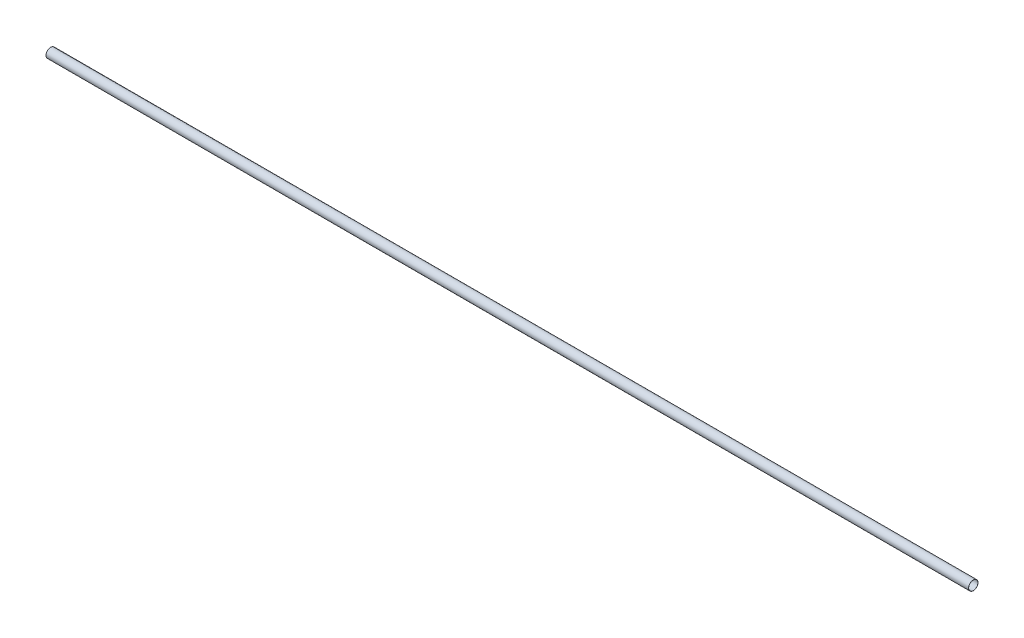
ISO-10303-21;
HEADER;
FILE_DESCRIPTION(('STEP AP214'),'2;1');
FILE_NAME('part.step','',(''),(''),'','','');
FILE_SCHEMA(('AUTOMOTIVE_DESIGN { 1 0 10303 214 1 1 1 1 }'));
ENDSEC;
DATA;
#1=APPLICATION_CONTEXT('core data for automotive mechanical design processes');
#2=APPLICATION_PROTOCOL_DEFINITION('international standard','automotive_design',2000,#1);
#3=PRODUCT_CONTEXT('',#1,'mechanical');
#4=PRODUCT('Part','Part','',(#3));
#5=PRODUCT_RELATED_PRODUCT_CATEGORY('part','',(#4));
#6=PRODUCT_DEFINITION_FORMATION('','',#4);
#7=PRODUCT_DEFINITION_CONTEXT('part definition',#1,'design');
#8=PRODUCT_DEFINITION('design','',#6,#7);
#9=PRODUCT_DEFINITION_SHAPE('','',#8);
#10=(LENGTH_UNIT() NAMED_UNIT(*) SI_UNIT(.MILLI.,.METRE.));
#11=(NAMED_UNIT(*) PLANE_ANGLE_UNIT() SI_UNIT($,.RADIAN.));
#12=(NAMED_UNIT(*) SI_UNIT($,.STERADIAN.) SOLID_ANGLE_UNIT());
#13=UNCERTAINTY_MEASURE_WITH_UNIT(LENGTH_MEASURE(1.E-05),#10,'distance_accuracy_value','');
#14=(GEOMETRIC_REPRESENTATION_CONTEXT(3) GLOBAL_UNCERTAINTY_ASSIGNED_CONTEXT((#13)) GLOBAL_UNIT_ASSIGNED_CONTEXT((#10,
#11,#12)) REPRESENTATION_CONTEXT('',''));
#15=CARTESIAN_POINT('',(0.,0.,0.));
#16=DIRECTION('',(0.,0.,1.));
#17=DIRECTION('',(1.,0.,0.));
#18=AXIS2_PLACEMENT_3D('',#15,#16,#17);
#19=CARTESIAN_POINT('',(0.,0.,0.));
#20=DIRECTION('',(-1.,0.,0.));
#21=DIRECTION('',(0.,0.,1.));
#22=AXIS2_PLACEMENT_3D('',#19,#20,#21);
#23=PLANE('',#22);
#24=CARTESIAN_POINT('',(0.,51.,0.));
#25=DIRECTION('',(-1.,0.,0.));
#26=DIRECTION('',(0.,0.,1.));
#27=AXIS2_PLACEMENT_3D('',#24,#25,#26);
#28=CIRCLE('',#27,50.);
#29=CARTESIAN_POINT('',(0.,51.,50.));
#30=VERTEX_POINT('',#29);
#31=EDGE_CURVE('E51',#30,#30,#28,.T.);
#32=ORIENTED_EDGE('',*,*,#31,.F.);
#33=EDGE_LOOP('',(#32));
#34=FACE_BOUND('',#33,.T.);
#35=CARTESIAN_POINT('',(0.,51.,0.));
#36=DIRECTION('',(-1.,0.,0.));
#37=DIRECTION('',(0.,0.,1.));
#38=AXIS2_PLACEMENT_3D('',#35,#36,#37);
#39=CIRCLE('',#38,51.);
#40=CARTESIAN_POINT('',(0.,51.,51.));
#41=VERTEX_POINT('',#40);
#42=EDGE_CURVE('E47',#41,#41,#39,.T.);
#43=ORIENTED_EDGE('',*,*,#42,.T.);
#44=EDGE_LOOP('',(#43));
#45=FACE_BOUND('',#44,.T.);
#46=ADVANCED_FACE('F40',(#34,#45),#23,.T.);
#47=CARTESIAN_POINT('',(10000.,0.,0.));
#48=DIRECTION('',(1.,0.,0.));
#49=DIRECTION('',(0.,0.,-1.));
#50=AXIS2_PLACEMENT_3D('',#47,#48,#49);
#51=PLANE('',#50);
#52=CARTESIAN_POINT('',(10000.,51.,0.));
#53=DIRECTION('',(1.,0.,0.));
#54=DIRECTION('',(0.,0.,-1.));
#55=AXIS2_PLACEMENT_3D('',#52,#53,#54);
#56=CIRCLE('',#55,50.);
#57=CARTESIAN_POINT('',(10000.,51.,-50.));
#58=VERTEX_POINT('',#57);
#59=EDGE_CURVE('E55',#58,#58,#56,.T.);
#60=ORIENTED_EDGE('',*,*,#59,.F.);
#61=EDGE_LOOP('',(#60));
#62=FACE_BOUND('',#61,.T.);
#63=CARTESIAN_POINT('',(10000.,51.,0.));
#64=DIRECTION('',(-1.,0.,0.));
#65=DIRECTION('',(0.,0.,1.));
#66=AXIS2_PLACEMENT_3D('',#63,#64,#65);
#67=CIRCLE('',#66,51.);
#68=CARTESIAN_POINT('',(10000.,51.,51.));
#69=VERTEX_POINT('',#68);
#70=EDGE_CURVE('E10',#69,#69,#67,.T.);
#71=ORIENTED_EDGE('',*,*,#70,.F.);
#72=EDGE_LOOP('',(#71));
#73=FACE_BOUND('',#72,.T.);
#74=ADVANCED_FACE('F62',(#62,#73),#51,.T.);
#75=CARTESIAN_POINT('',(0.,51.,0.));
#76=DIRECTION('',(-1.,0.,0.));
#77=DIRECTION('',(0.,0.,1.));
#78=AXIS2_PLACEMENT_3D('',#75,#76,#77);
#79=CYLINDRICAL_SURFACE('',#78,51.);
#80=ORIENTED_EDGE('',*,*,#70,.T.);
#81=EDGE_LOOP('',(#80));
#82=FACE_BOUND('',#81,.T.);
#83=ORIENTED_EDGE('',*,*,#42,.F.);
#84=EDGE_LOOP('',(#83));
#85=FACE_BOUND('',#84,.T.);
#86=ADVANCED_FACE('F65',(#82,#85),#79,.T.);
#87=CARTESIAN_POINT('',(0.,51.,0.));
#88=DIRECTION('',(-1.,0.,0.));
#89=DIRECTION('',(0.,0.,1.));
#90=AXIS2_PLACEMENT_3D('',#87,#88,#89);
#91=CYLINDRICAL_SURFACE('',#90,50.);
#92=ORIENTED_EDGE('',*,*,#31,.T.);
#93=EDGE_LOOP('',(#92));
#94=FACE_BOUND('',#93,.T.);
#95=ORIENTED_EDGE('',*,*,#59,.T.);
#96=EDGE_LOOP('',(#95));
#97=FACE_BOUND('',#96,.T.);
#98=ADVANCED_FACE('F42',(#94,#97),#91,.F.);
#99=CLOSED_SHELL('',(#46,#74,#86,#98));
#100=MANIFOLD_SOLID_BREP('B2',#99);
#101=ADVANCED_BREP_SHAPE_REPRESENTATION('',(#18,#100),#14);
#102=SHAPE_DEFINITION_REPRESENTATION(#9,#101);
ENDSEC;
END-ISO-10303-21;
